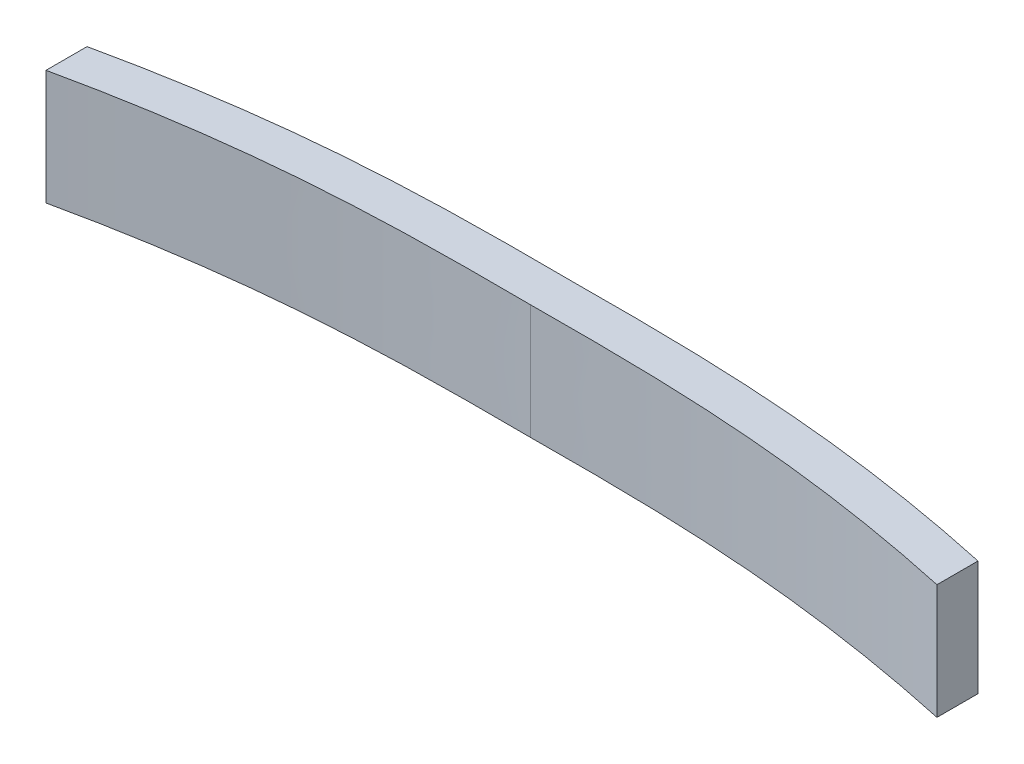
ISO-10303-21;
HEADER;
FILE_DESCRIPTION(('STEP AP214'),'2;1');
FILE_NAME('part.step','',(''),(''),'','','');
FILE_SCHEMA(('AUTOMOTIVE_DESIGN { 1 0 10303 214 1 1 1 1 }'));
ENDSEC;
DATA;
#1=APPLICATION_CONTEXT('core data for automotive mechanical design processes');
#2=APPLICATION_PROTOCOL_DEFINITION('international standard','automotive_design',2000,#1);
#3=PRODUCT_CONTEXT('',#1,'mechanical');
#4=PRODUCT('Part','Part','',(#3));
#5=PRODUCT_RELATED_PRODUCT_CATEGORY('part','',(#4));
#6=PRODUCT_DEFINITION_FORMATION('','',#4);
#7=PRODUCT_DEFINITION_CONTEXT('part definition',#1,'design');
#8=PRODUCT_DEFINITION('design','',#6,#7);
#9=PRODUCT_DEFINITION_SHAPE('','',#8);
#10=(LENGTH_UNIT() NAMED_UNIT(*) SI_UNIT(.MILLI.,.METRE.));
#11=(NAMED_UNIT(*) PLANE_ANGLE_UNIT() SI_UNIT($,.RADIAN.));
#12=(NAMED_UNIT(*) SI_UNIT($,.STERADIAN.) SOLID_ANGLE_UNIT());
#13=UNCERTAINTY_MEASURE_WITH_UNIT(LENGTH_MEASURE(1.E-05),#10,'distance_accuracy_value','');
#14=(GEOMETRIC_REPRESENTATION_CONTEXT(3) GLOBAL_UNCERTAINTY_ASSIGNED_CONTEXT((#13)) GLOBAL_UNIT_ASSIGNED_CONTEXT((#10,
#11,#12)) REPRESENTATION_CONTEXT('',''));
#15=CARTESIAN_POINT('',(0.,0.,0.));
#16=DIRECTION('',(0.,0.,1.));
#17=DIRECTION('',(1.,0.,0.));
#18=AXIS2_PLACEMENT_3D('',#15,#16,#17);
#19=CARTESIAN_POINT('',(51.827852841315,14.,-3.04277027427121));
#20=CARTESIAN_POINT('',(43.4406782163176,14.,-4.87053409091255));
#21=CARTESIAN_POINT('',(30.1443444906021,14.,-6.93787877011409));
#22=CARTESIAN_POINT('',(11.9963198104847,14.,-7.86033235212055));
#23=CARTESIAN_POINT('',(2.7227919616481,14.,-7.84493417488937));
#24=CARTESIAN_POINT('',(-2.44151387951423,14.,-7.81770268280025));
#25=B_SPLINE_CURVE_WITH_KNOTS('',3,(#19,#20,#21,#22,#23,#24),.UNSPECIFIED.,.F.,.F.,(4,1,1,4),
(0.,0.47203113006856,0.735860592725768,1.),.UNSPECIFIED.);
#26=DIRECTION('',(0.,-1.,0.));
#27=VECTOR('',#26,1.);
#28=SURFACE_OF_LINEAR_EXTRUSION('',#25,#27);
#29=CARTESIAN_POINT('',(51.827852841315,0.,-3.04277027427121));
#30=CARTESIAN_POINT('',(43.4406782163176,0.,-4.87053409091255));
#31=CARTESIAN_POINT('',(30.1443444906021,0.,-6.93787877011409));
#32=CARTESIAN_POINT('',(11.9963198104847,0.,-7.86033235212055));
#33=CARTESIAN_POINT('',(2.7227919616481,0.,-7.84493417488937));
#34=CARTESIAN_POINT('',(-2.44151387951423,0.,-7.81770268280025));
#35=B_SPLINE_CURVE_WITH_KNOTS('',3,(#29,#30,#31,#32,#33,#34),.UNSPECIFIED.,.F.,.F.,(4,1,1,4),
(0.,0.47203113006856,0.735860592725768,1.),.UNSPECIFIED.);
#36=CARTESIAN_POINT('',(51.8278528413148,0.,-3.04277027427121));
#37=VERTEX_POINT('',#36);
#38=CARTESIAN_POINT('',(-2.44151387951424,0.,-7.81770268280025));
#39=VERTEX_POINT('',#38);
#40=EDGE_CURVE('E150',#37,#39,#35,.T.);
#41=ORIENTED_EDGE('',*,*,#40,.F.);
#42=DIRECTION('',(0.,-1.,0.));
#43=VECTOR('',#42,1.);
#44=CARTESIAN_POINT('',(51.8278528413148,14.,-3.04277027427121));
#45=LINE('',#44,#43);
#46=CARTESIAN_POINT('',(51.8278528413148,14.,-3.04277027427121));
#47=VERTEX_POINT('',#46);
#48=EDGE_CURVE('E11',#47,#37,#45,.T.);
#49=ORIENTED_EDGE('',*,*,#48,.F.);
#50=CARTESIAN_POINT('',(-2.44151387951424,14.,-7.81770268280025));
#51=VERTEX_POINT('',#50);
#52=EDGE_CURVE('E174',#47,#51,#25,.T.);
#53=ORIENTED_EDGE('',*,*,#52,.T.);
#54=DIRECTION('',(0.,-1.,0.));
#55=VECTOR('',#54,1.);
#56=CARTESIAN_POINT('',(-2.44151387951424,14.,-7.81770268280025));
#57=LINE('',#56,#55);
#58=EDGE_CURVE('E82',#51,#39,#57,.T.);
#59=ORIENTED_EDGE('',*,*,#58,.T.);
#60=EDGE_LOOP('',(#41,#49,#53,#59));
#61=FACE_BOUND('',#60,.T.);
#62=ADVANCED_FACE('F37',(#61),#28,.T.);
#63=CARTESIAN_POINT('',(51.8278528413148,14.,5.394419581998E-13));
#64=DIRECTION('',(1.,0.,0.));
#65=DIRECTION('',(0.,0.,-1.));
#66=AXIS2_PLACEMENT_3D('',#63,#64,#65);
#67=PLANE('',#66);
#68=DIRECTION('',(0.,0.,1.));
#69=VECTOR('',#68,1.);
#70=CARTESIAN_POINT('',(51.8278528413148,0.,5.394419581998E-13));
#71=LINE('',#70,#69);
#72=CARTESIAN_POINT('',(51.8278528413149,0.,-8.04277027427121));
#73=VERTEX_POINT('',#72);
#74=EDGE_CURVE('E144',#73,#37,#71,.T.);
#75=ORIENTED_EDGE('',*,*,#74,.F.);
#76=DIRECTION('',(0.,-1.,0.));
#77=VECTOR('',#76,1.);
#78=CARTESIAN_POINT('',(51.8278528413149,14.,-8.04277027427121));
#79=LINE('',#78,#77);
#80=CARTESIAN_POINT('',(51.8278528413149,14.,-8.04277027427121));
#81=VERTEX_POINT('',#80);
#82=EDGE_CURVE('E46',#81,#73,#79,.T.);
#83=ORIENTED_EDGE('',*,*,#82,.F.);
#84=DIRECTION('',(0.,0.,1.));
#85=VECTOR('',#84,1.);
#86=CARTESIAN_POINT('',(51.8278528413148,14.,5.394419581998E-13));
#87=LINE('',#86,#85);
#88=EDGE_CURVE('E115',#81,#47,#87,.T.);
#89=ORIENTED_EDGE('',*,*,#88,.T.);
#90=ORIENTED_EDGE('',*,*,#48,.T.);
#91=EDGE_LOOP('',(#75,#83,#89,#90));
#92=FACE_BOUND('',#91,.T.);
#93=ADVANCED_FACE('F135',(#92),#67,.T.);
#94=CARTESIAN_POINT('',(51.8278528413149,14.,-8.04277027427127));
#95=CARTESIAN_POINT('',(43.4406782163175,14.,-9.87053409091253));
#96=CARTESIAN_POINT('',(30.1443444906021,14.,-11.9378787701141));
#97=CARTESIAN_POINT('',(11.9963198104846,14.,-12.8603323521206));
#98=CARTESIAN_POINT('',(2.72279196164815,14.,-12.8449341748894));
#99=CARTESIAN_POINT('',(-2.4415138795143,14.,-12.8177026828002));
#100=B_SPLINE_CURVE_WITH_KNOTS('',3,(#94,#95,#96,#97,#98,#99),.UNSPECIFIED.,.F.,.F.,(4,1,1,4),
(0.,0.47203113006856,0.735860592725768,1.),.UNSPECIFIED.);
#101=DIRECTION('',(0.,-1.,0.));
#102=VECTOR('',#101,1.);
#103=SURFACE_OF_LINEAR_EXTRUSION('',#100,#102);
#104=CARTESIAN_POINT('',(51.8278528413149,0.,-8.04277027427127));
#105=CARTESIAN_POINT('',(43.4406782163175,0.,-9.87053409091253));
#106=CARTESIAN_POINT('',(30.1443444906021,0.,-11.9378787701141));
#107=CARTESIAN_POINT('',(11.9963198104846,0.,-12.8603323521206));
#108=CARTESIAN_POINT('',(2.72279196164815,0.,-12.8449341748894));
#109=CARTESIAN_POINT('',(-2.4415138795143,0.,-12.8177026828002));
#110=B_SPLINE_CURVE_WITH_KNOTS('',3,(#104,#105,#106,#107,#108,#109),.UNSPECIFIED.,.F.,.F.,(4,1,
1,4),(0.,0.47203113006856,0.735860592725768,1.),.UNSPECIFIED.);
#111=CARTESIAN_POINT('',(-2.44151387951431,0.,-12.8177026828002));
#112=VERTEX_POINT('',#111);
#113=EDGE_CURVE('E149',#73,#112,#110,.T.);
#114=ORIENTED_EDGE('',*,*,#113,.T.);
#115=DIRECTION('',(0.,-1.,0.));
#116=VECTOR('',#115,1.);
#117=CARTESIAN_POINT('',(-2.44151387951431,14.,-12.8177026828002));
#118=LINE('',#117,#116);
#119=CARTESIAN_POINT('',(-2.44151387951431,14.,-12.8177026828002));
#120=VERTEX_POINT('',#119);
#121=EDGE_CURVE('E103',#120,#112,#118,.T.);
#122=ORIENTED_EDGE('',*,*,#121,.F.);
#123=EDGE_CURVE('E112',#81,#120,#100,.T.);
#124=ORIENTED_EDGE('',*,*,#123,.F.);
#125=ORIENTED_EDGE('',*,*,#82,.T.);
#126=EDGE_LOOP('',(#114,#122,#124,#125));
#127=FACE_BOUND('',#126,.T.);
#128=ADVANCED_FACE('F132',(#127),#103,.F.);
#129=CARTESIAN_POINT('',(-56.7108806003435,14.,-8.04277027427121));
#130=CARTESIAN_POINT('',(-48.3237059753461,14.,-9.87053409091254));
#131=CARTESIAN_POINT('',(-35.0273722496307,14.,-11.9378787701141));
#132=CARTESIAN_POINT('',(-16.8793475695132,14.,-12.8603323521206));
#133=CARTESIAN_POINT('',(-7.60581972067675,14.,-12.8449341748894));
#134=CARTESIAN_POINT('',(-2.44151387951431,14.,-12.8177026828002));
#135=B_SPLINE_CURVE_WITH_KNOTS('',3,(#129,#130,#131,#132,#133,#134),.UNSPECIFIED.,.F.,.F.,(4,1,
1,4),(0.,0.47203113006856,0.735860592725768,1.),.UNSPECIFIED.);
#136=DIRECTION('',(0.,-1.,0.));
#137=VECTOR('',#136,1.);
#138=SURFACE_OF_LINEAR_EXTRUSION('',#135,#137);
#139=CARTESIAN_POINT('',(-56.7108806003435,0.,-8.04277027427121));
#140=CARTESIAN_POINT('',(-48.3237059753461,0.,-9.87053409091254));
#141=CARTESIAN_POINT('',(-35.0273722496307,0.,-11.9378787701141));
#142=CARTESIAN_POINT('',(-16.8793475695132,0.,-12.8603323521206));
#143=CARTESIAN_POINT('',(-7.60581972067675,0.,-12.8449341748894));
#144=CARTESIAN_POINT('',(-2.44151387951431,0.,-12.8177026828002));
#145=B_SPLINE_CURVE_WITH_KNOTS('',3,(#139,#140,#141,#142,#143,#144),.UNSPECIFIED.,.F.,.F.,(4,1,
1,4),(0.,0.47203113006856,0.735860592725768,1.),.UNSPECIFIED.);
#146=CARTESIAN_POINT('',(-56.7108806003435,0.,-8.04277027427121));
#147=VERTEX_POINT('',#146);
#148=EDGE_CURVE('E102',#147,#112,#145,.T.);
#149=ORIENTED_EDGE('',*,*,#148,.F.);
#150=DIRECTION('',(0.,-1.,0.));
#151=VECTOR('',#150,1.);
#152=CARTESIAN_POINT('',(-56.7108806003435,14.,-8.04277027427121));
#153=LINE('',#152,#151);
#154=CARTESIAN_POINT('',(-56.7108806003435,14.,-8.04277027427121));
#155=VERTEX_POINT('',#154);
#156=EDGE_CURVE('E96',#155,#147,#153,.T.);
#157=ORIENTED_EDGE('',*,*,#156,.F.);
#158=EDGE_CURVE('E100',#155,#120,#135,.T.);
#159=ORIENTED_EDGE('',*,*,#158,.T.);
#160=ORIENTED_EDGE('',*,*,#121,.T.);
#161=EDGE_LOOP('',(#149,#157,#159,#160));
#162=FACE_BOUND('',#161,.T.);
#163=ADVANCED_FACE('F98',(#162),#138,.T.);
#164=CARTESIAN_POINT('',(-56.7108806003434,14.,5.902661755244E-13));
#165=DIRECTION('',(1.,0.,0.));
#166=DIRECTION('',(0.,0.,-1.));
#167=AXIS2_PLACEMENT_3D('',#164,#165,#166);
#168=PLANE('',#167);
#169=DIRECTION('',(0.,0.,1.));
#170=VECTOR('',#169,1.);
#171=CARTESIAN_POINT('',(-56.7108806003434,0.,5.902661755244E-13));
#172=LINE('',#171,#170);
#173=CARTESIAN_POINT('',(-56.7108806003434,0.,-3.04277027427121));
#174=VERTEX_POINT('',#173);
#175=EDGE_CURVE('E75',#147,#174,#172,.T.);
#176=ORIENTED_EDGE('',*,*,#175,.T.);
#177=DIRECTION('',(0.,-1.,0.));
#178=VECTOR('',#177,1.);
#179=CARTESIAN_POINT('',(-56.7108806003434,14.,-3.04277027427121));
#180=LINE('',#179,#178);
#181=CARTESIAN_POINT('',(-56.7108806003434,14.,-3.04277027427121));
#182=VERTEX_POINT('',#181);
#183=EDGE_CURVE('E104',#182,#174,#180,.T.);
#184=ORIENTED_EDGE('',*,*,#183,.F.);
#185=DIRECTION('',(0.,0.,1.));
#186=VECTOR('',#185,1.);
#187=CARTESIAN_POINT('',(-56.7108806003434,14.,5.902661755244E-13));
#188=LINE('',#187,#186);
#189=EDGE_CURVE('E106',#155,#182,#188,.T.);
#190=ORIENTED_EDGE('',*,*,#189,.F.);
#191=ORIENTED_EDGE('',*,*,#156,.T.);
#192=EDGE_LOOP('',(#176,#184,#190,#191));
#193=FACE_BOUND('',#192,.T.);
#194=ADVANCED_FACE('F107',(#193),#168,.F.);
#195=CARTESIAN_POINT('',(-56.7108806003434,14.,-3.04277027427121));
#196=CARTESIAN_POINT('',(-48.323705975346,14.,-4.87053409091255));
#197=CARTESIAN_POINT('',(-35.0273722496306,14.,-6.93787877011409));
#198=CARTESIAN_POINT('',(-16.8793475695131,14.,-7.86033235212055));
#199=CARTESIAN_POINT('',(-7.60581972067668,14.,-7.84493417488936));
#200=CARTESIAN_POINT('',(-2.44151387951424,14.,-7.81770268280025));
#201=B_SPLINE_CURVE_WITH_KNOTS('',3,(#195,#196,#197,#198,#199,#200),.UNSPECIFIED.,.F.,.F.,(4,1,
1,4),(0.,0.47203113006856,0.735860592725768,1.),.UNSPECIFIED.);
#202=DIRECTION('',(0.,-1.,0.));
#203=VECTOR('',#202,1.);
#204=SURFACE_OF_LINEAR_EXTRUSION('',#201,#203);
#205=CARTESIAN_POINT('',(-56.7108806003434,0.,-3.04277027427121));
#206=CARTESIAN_POINT('',(-48.323705975346,0.,-4.87053409091255));
#207=CARTESIAN_POINT('',(-35.0273722496306,0.,-6.93787877011409));
#208=CARTESIAN_POINT('',(-16.8793475695131,0.,-7.86033235212055));
#209=CARTESIAN_POINT('',(-7.60581972067668,0.,-7.84493417488936));
#210=CARTESIAN_POINT('',(-2.44151387951424,0.,-7.81770268280025));
#211=B_SPLINE_CURVE_WITH_KNOTS('',3,(#205,#206,#207,#208,#209,#210),.UNSPECIFIED.,.F.,.F.,(4,1,
1,4),(0.,0.47203113006856,0.735860592725768,1.),.UNSPECIFIED.);
#212=EDGE_CURVE('E170',#174,#39,#211,.T.);
#213=ORIENTED_EDGE('',*,*,#212,.T.);
#214=ORIENTED_EDGE('',*,*,#58,.F.);
#215=EDGE_CURVE('E54',#182,#51,#201,.T.);
#216=ORIENTED_EDGE('',*,*,#215,.F.);
#217=ORIENTED_EDGE('',*,*,#183,.T.);
#218=EDGE_LOOP('',(#213,#214,#216,#217));
#219=FACE_BOUND('',#218,.T.);
#220=ADVANCED_FACE('F183',(#219),#204,.F.);
#221=CARTESIAN_POINT('',(0.,14.,0.));
#222=DIRECTION('',(0.,1.,0.));
#223=DIRECTION('',(0.,0.,1.));
#224=AXIS2_PLACEMENT_3D('',#221,#222,#223);
#225=PLANE('',#224);
#226=ORIENTED_EDGE('',*,*,#52,.F.);
#227=ORIENTED_EDGE('',*,*,#88,.F.);
#228=ORIENTED_EDGE('',*,*,#123,.T.);
#229=ORIENTED_EDGE('',*,*,#158,.F.);
#230=ORIENTED_EDGE('',*,*,#189,.T.);
#231=ORIENTED_EDGE('',*,*,#215,.T.);
#232=EDGE_LOOP('',(#226,#227,#228,#229,#230,#231));
#233=FACE_BOUND('',#232,.T.);
#234=ADVANCED_FACE('F109',(#233),#225,.T.);
#235=CARTESIAN_POINT('',(0.,0.,0.));
#236=DIRECTION('',(0.,1.,0.));
#237=DIRECTION('',(0.,0.,1.));
#238=AXIS2_PLACEMENT_3D('',#235,#236,#237);
#239=PLANE('',#238);
#240=ORIENTED_EDGE('',*,*,#40,.T.);
#241=ORIENTED_EDGE('',*,*,#212,.F.);
#242=ORIENTED_EDGE('',*,*,#175,.F.);
#243=ORIENTED_EDGE('',*,*,#148,.T.);
#244=ORIENTED_EDGE('',*,*,#113,.F.);
#245=ORIENTED_EDGE('',*,*,#74,.T.);
#246=EDGE_LOOP('',(#240,#241,#242,#243,#244,#245));
#247=FACE_BOUND('',#246,.T.);
#248=ADVANCED_FACE('F180',(#247),#239,.F.);
#249=CLOSED_SHELL('',(#62,#93,#128,#163,#194,#220,#234,#248));
#250=MANIFOLD_SOLID_BREP('B2',#249);
#251=ADVANCED_BREP_SHAPE_REPRESENTATION('',(#18,#250),#14);
#252=SHAPE_DEFINITION_REPRESENTATION(#9,#251);
ENDSEC;
END-ISO-10303-21;
